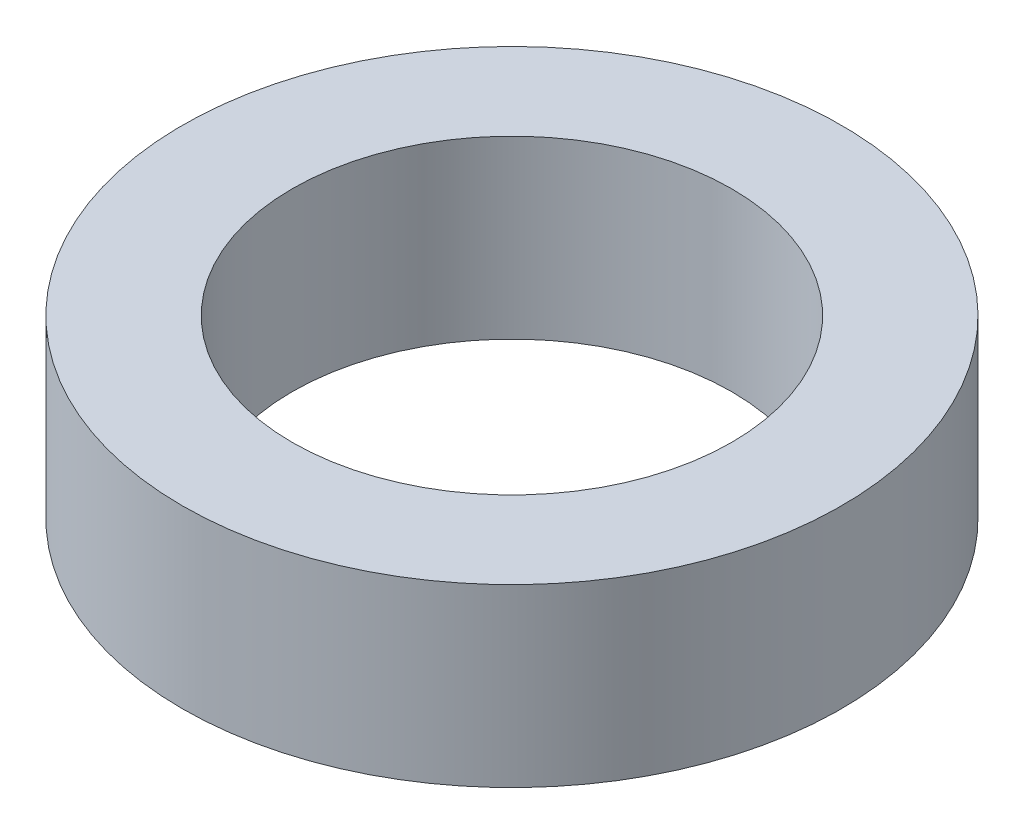
ISO-10303-21;
HEADER;
FILE_DESCRIPTION(('STEP AP214'),'2;1');
FILE_NAME('part.step','',(''),(''),'','','');
FILE_SCHEMA(('AUTOMOTIVE_DESIGN { 1 0 10303 214 1 1 1 1 }'));
ENDSEC;
DATA;
#1=APPLICATION_CONTEXT('core data for automotive mechanical design processes');
#2=APPLICATION_PROTOCOL_DEFINITION('international standard','automotive_design',2000,#1);
#3=PRODUCT_CONTEXT('',#1,'mechanical');
#4=PRODUCT('Part','Part','',(#3));
#5=PRODUCT_RELATED_PRODUCT_CATEGORY('part','',(#4));
#6=PRODUCT_DEFINITION_FORMATION('','',#4);
#7=PRODUCT_DEFINITION_CONTEXT('part definition',#1,'design');
#8=PRODUCT_DEFINITION('design','',#6,#7);
#9=PRODUCT_DEFINITION_SHAPE('','',#8);
#10=(LENGTH_UNIT() NAMED_UNIT(*) SI_UNIT(.MILLI.,.METRE.));
#11=(NAMED_UNIT(*) PLANE_ANGLE_UNIT() SI_UNIT($,.RADIAN.));
#12=(NAMED_UNIT(*) SI_UNIT($,.STERADIAN.) SOLID_ANGLE_UNIT());
#13=UNCERTAINTY_MEASURE_WITH_UNIT(LENGTH_MEASURE(1.E-05),#10,'distance_accuracy_value','');
#14=(GEOMETRIC_REPRESENTATION_CONTEXT(3) GLOBAL_UNCERTAINTY_ASSIGNED_CONTEXT((#13)) GLOBAL_UNIT_ASSIGNED_CONTEXT((#10,
#11,#12)) REPRESENTATION_CONTEXT('',''));
#15=CARTESIAN_POINT('',(0.,0.,0.));
#16=DIRECTION('',(0.,0.,1.));
#17=DIRECTION('',(1.,0.,0.));
#18=AXIS2_PLACEMENT_3D('',#15,#16,#17);
#19=CARTESIAN_POINT('',(0.,1.6,0.));
#20=DIRECTION('',(0.,1.,0.));
#21=DIRECTION('',(0.,0.,1.));
#22=AXIS2_PLACEMENT_3D('',#19,#20,#21);
#23=PLANE('',#22);
#24=CARTESIAN_POINT('',(0.,1.6,0.));
#25=DIRECTION('',(0.,1.,0.));
#26=DIRECTION('',(0.,0.,1.));
#27=AXIS2_PLACEMENT_3D('',#24,#25,#26);
#28=CIRCLE('',#27,2.999994);
#29=CARTESIAN_POINT('',(0.,1.6,2.999994));
#30=VERTEX_POINT('',#29);
#31=EDGE_CURVE('E10',#30,#30,#28,.T.);
#32=ORIENTED_EDGE('',*,*,#31,.T.);
#33=EDGE_LOOP('',(#32));
#34=FACE_BOUND('',#33,.T.);
#35=CARTESIAN_POINT('',(0.,1.6,0.));
#36=DIRECTION('',(0.,1.,0.));
#37=DIRECTION('',(0.,0.,1.));
#38=AXIS2_PLACEMENT_3D('',#35,#36,#37);
#39=CIRCLE('',#38,1.999996);
#40=CARTESIAN_POINT('',(0.,1.6,1.999996));
#41=VERTEX_POINT('',#40);
#42=EDGE_CURVE('E46',#41,#41,#39,.T.);
#43=ORIENTED_EDGE('',*,*,#42,.F.);
#44=EDGE_LOOP('',(#43));
#45=FACE_BOUND('',#44,.T.);
#46=ADVANCED_FACE('F35',(#34,#45),#23,.T.);
#47=CARTESIAN_POINT('',(0.,0.,0.));
#48=DIRECTION('',(0.,1.,0.));
#49=DIRECTION('',(0.,0.,1.));
#50=AXIS2_PLACEMENT_3D('',#47,#48,#49);
#51=PLANE('',#50);
#52=CARTESIAN_POINT('',(0.,0.,0.));
#53=DIRECTION('',(0.,1.,0.));
#54=DIRECTION('',(0.,0.,1.));
#55=AXIS2_PLACEMENT_3D('',#52,#53,#54);
#56=CIRCLE('',#55,2.999994);
#57=CARTESIAN_POINT('',(0.,0.,2.999994));
#58=VERTEX_POINT('',#57);
#59=EDGE_CURVE('E39',#58,#58,#56,.T.);
#60=ORIENTED_EDGE('',*,*,#59,.F.);
#61=EDGE_LOOP('',(#60));
#62=FACE_BOUND('',#61,.T.);
#63=CARTESIAN_POINT('',(0.,0.,0.));
#64=DIRECTION('',(0.,1.,0.));
#65=DIRECTION('',(0.,0.,1.));
#66=AXIS2_PLACEMENT_3D('',#63,#64,#65);
#67=CIRCLE('',#66,1.999996);
#68=CARTESIAN_POINT('',(0.,0.,1.999996));
#69=VERTEX_POINT('',#68);
#70=EDGE_CURVE('E48',#69,#69,#67,.T.);
#71=ORIENTED_EDGE('',*,*,#70,.T.);
#72=EDGE_LOOP('',(#71));
#73=FACE_BOUND('',#72,.T.);
#74=ADVANCED_FACE('F58',(#62,#73),#51,.F.);
#75=CARTESIAN_POINT('',(0.,1.6,0.));
#76=DIRECTION('',(0.,-1.,0.));
#77=DIRECTION('',(0.,0.,-1.));
#78=AXIS2_PLACEMENT_3D('',#75,#76,#77);
#79=CYLINDRICAL_SURFACE('',#78,2.999994);
#80=ORIENTED_EDGE('',*,*,#31,.F.);
#81=EDGE_LOOP('',(#80));
#82=FACE_BOUND('',#81,.T.);
#83=ORIENTED_EDGE('',*,*,#59,.T.);
#84=EDGE_LOOP('',(#83));
#85=FACE_BOUND('',#84,.T.);
#86=ADVANCED_FACE('F37',(#82,#85),#79,.T.);
#87=CARTESIAN_POINT('',(0.,1.6,0.));
#88=DIRECTION('',(0.,-1.,0.));
#89=DIRECTION('',(0.,0.,-1.));
#90=AXIS2_PLACEMENT_3D('',#87,#88,#89);
#91=CYLINDRICAL_SURFACE('',#90,1.999996);
#92=ORIENTED_EDGE('',*,*,#42,.T.);
#93=EDGE_LOOP('',(#92));
#94=FACE_BOUND('',#93,.T.);
#95=ORIENTED_EDGE('',*,*,#70,.F.);
#96=EDGE_LOOP('',(#95));
#97=FACE_BOUND('',#96,.T.);
#98=ADVANCED_FACE('F54',(#94,#97),#91,.F.);
#99=CLOSED_SHELL('',(#46,#74,#86,#98));
#100=MANIFOLD_SOLID_BREP('B2',#99);
#101=ADVANCED_BREP_SHAPE_REPRESENTATION('',(#18,#100),#14);
#102=SHAPE_DEFINITION_REPRESENTATION(#9,#101);
ENDSEC;
END-ISO-10303-21;
